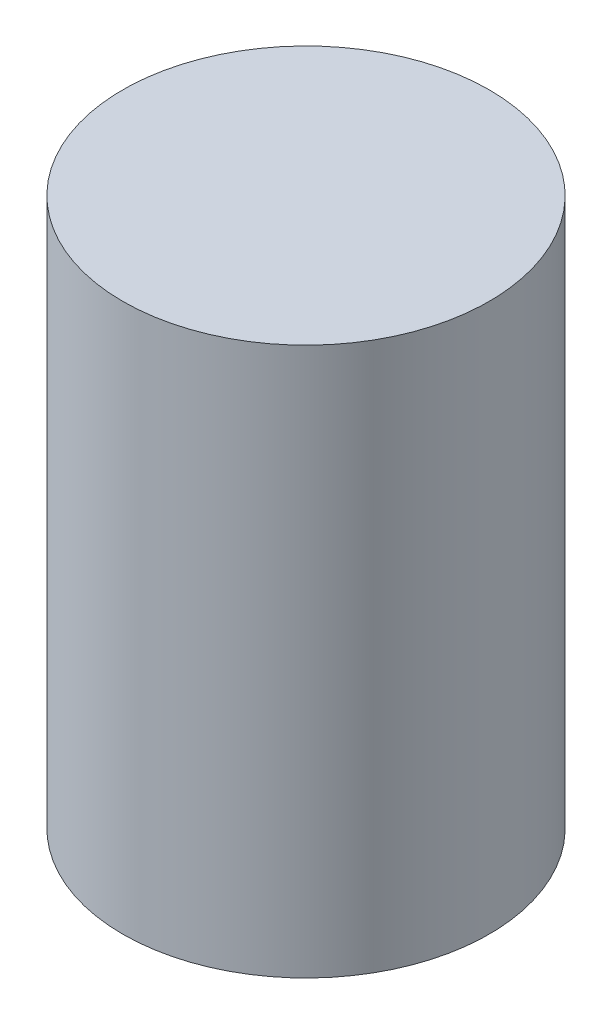
ISO-10303-21;
HEADER;
FILE_DESCRIPTION(('STEP AP214'),'2;1');
FILE_NAME('part.step','',(''),(''),'','','');
FILE_SCHEMA(('AUTOMOTIVE_DESIGN { 1 0 10303 214 1 1 1 1 }'));
ENDSEC;
DATA;
#1=APPLICATION_CONTEXT('core data for automotive mechanical design processes');
#2=APPLICATION_PROTOCOL_DEFINITION('international standard','automotive_design',2000,#1);
#3=PRODUCT_CONTEXT('',#1,'mechanical');
#4=PRODUCT('Part','Part','',(#3));
#5=PRODUCT_RELATED_PRODUCT_CATEGORY('part','',(#4));
#6=PRODUCT_DEFINITION_FORMATION('','',#4);
#7=PRODUCT_DEFINITION_CONTEXT('part definition',#1,'design');
#8=PRODUCT_DEFINITION('design','',#6,#7);
#9=PRODUCT_DEFINITION_SHAPE('','',#8);
#10=(LENGTH_UNIT() NAMED_UNIT(*) SI_UNIT(.MILLI.,.METRE.));
#11=(NAMED_UNIT(*) PLANE_ANGLE_UNIT() SI_UNIT($,.RADIAN.));
#12=(NAMED_UNIT(*) SI_UNIT($,.STERADIAN.) SOLID_ANGLE_UNIT());
#13=UNCERTAINTY_MEASURE_WITH_UNIT(LENGTH_MEASURE(1.E-05),#10,'distance_accuracy_value','');
#14=(GEOMETRIC_REPRESENTATION_CONTEXT(3) GLOBAL_UNCERTAINTY_ASSIGNED_CONTEXT((#13)) GLOBAL_UNIT_ASSIGNED_CONTEXT((#10,
#11,#12)) REPRESENTATION_CONTEXT('',''));
#15=CARTESIAN_POINT('',(0.,0.,0.));
#16=DIRECTION('',(0.,0.,1.));
#17=DIRECTION('',(1.,0.,0.));
#18=AXIS2_PLACEMENT_3D('',#15,#16,#17);
#19=CARTESIAN_POINT('',(0.,66.548,0.));
#20=DIRECTION('',(0.,-1.,0.));
#21=DIRECTION('',(0.,0.,-1.));
#22=AXIS2_PLACEMENT_3D('',#19,#20,#21);
#23=CYLINDRICAL_SURFACE('',#22,22.2504);
#24=CARTESIAN_POINT('',(0.,66.548,0.));
#25=DIRECTION('',(0.,1.,0.));
#26=DIRECTION('',(0.,0.,1.));
#27=AXIS2_PLACEMENT_3D('',#24,#25,#26);
#28=CIRCLE('',#27,22.2504);
#29=CARTESIAN_POINT('',(0.,66.548,22.2504));
#30=VERTEX_POINT('',#29);
#31=EDGE_CURVE('E10',#30,#30,#28,.T.);
#32=ORIENTED_EDGE('',*,*,#31,.F.);
#33=EDGE_LOOP('',(#32));
#34=FACE_BOUND('',#33,.T.);
#35=CARTESIAN_POINT('',(0.,0.,0.));
#36=DIRECTION('',(0.,1.,0.));
#37=DIRECTION('',(0.,0.,1.));
#38=AXIS2_PLACEMENT_3D('',#35,#36,#37);
#39=CIRCLE('',#38,22.2504);
#40=CARTESIAN_POINT('',(0.,0.,22.2504));
#41=VERTEX_POINT('',#40);
#42=EDGE_CURVE('E34',#41,#41,#39,.T.);
#43=ORIENTED_EDGE('',*,*,#42,.T.);
#44=EDGE_LOOP('',(#43));
#45=FACE_BOUND('',#44,.T.);
#46=ADVANCED_FACE('F31',(#34,#45),#23,.T.);
#47=CARTESIAN_POINT('',(0.,66.548,0.));
#48=DIRECTION('',(0.,1.,0.));
#49=DIRECTION('',(0.,0.,1.));
#50=AXIS2_PLACEMENT_3D('',#47,#48,#49);
#51=PLANE('',#50);
#52=ORIENTED_EDGE('',*,*,#31,.T.);
#53=EDGE_LOOP('',(#52));
#54=FACE_BOUND('',#53,.T.);
#55=ADVANCED_FACE('F46',(#54),#51,.T.);
#56=CARTESIAN_POINT('',(0.,0.,0.));
#57=DIRECTION('',(0.,1.,0.));
#58=DIRECTION('',(0.,0.,1.));
#59=AXIS2_PLACEMENT_3D('',#56,#57,#58);
#60=PLANE('',#59);
#61=ORIENTED_EDGE('',*,*,#42,.F.);
#62=EDGE_LOOP('',(#61));
#63=FACE_BOUND('',#62,.T.);
#64=ADVANCED_FACE('F44',(#63),#60,.F.);
#65=CLOSED_SHELL('',(#46,#55,#64));
#66=MANIFOLD_SOLID_BREP('B2',#65);
#67=ADVANCED_BREP_SHAPE_REPRESENTATION('',(#18,#66),#14);
#68=SHAPE_DEFINITION_REPRESENTATION(#9,#67);
ENDSEC;
END-ISO-10303-21;
